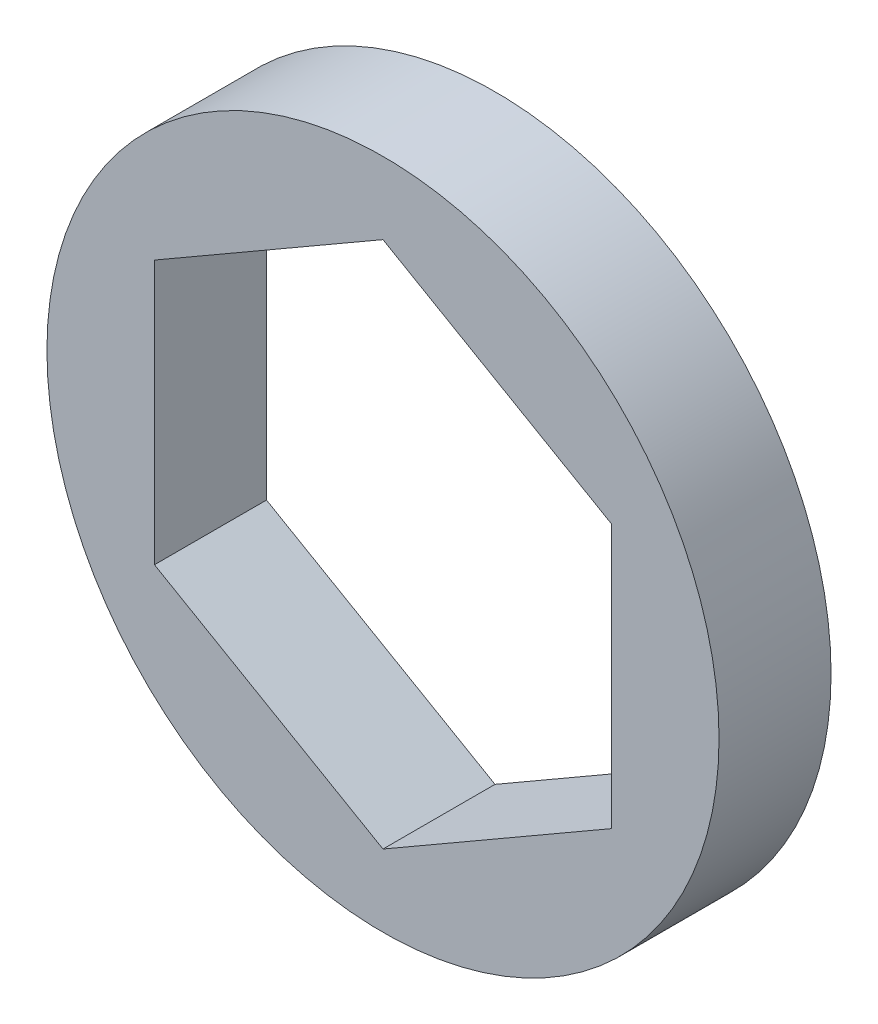
ISO-10303-21;
HEADER;
FILE_DESCRIPTION(('STEP AP214'),'2;1');
FILE_NAME('part.step','',(''),(''),'','','');
FILE_SCHEMA(('AUTOMOTIVE_DESIGN { 1 0 10303 214 1 1 1 1 }'));
ENDSEC;
DATA;
#1=APPLICATION_CONTEXT('core data for automotive mechanical design processes');
#2=APPLICATION_PROTOCOL_DEFINITION('international standard','automotive_design',2000,#1);
#3=PRODUCT_CONTEXT('',#1,'mechanical');
#4=PRODUCT('Part','Part','',(#3));
#5=PRODUCT_RELATED_PRODUCT_CATEGORY('part','',(#4));
#6=PRODUCT_DEFINITION_FORMATION('','',#4);
#7=PRODUCT_DEFINITION_CONTEXT('part definition',#1,'design');
#8=PRODUCT_DEFINITION('design','',#6,#7);
#9=PRODUCT_DEFINITION_SHAPE('','',#8);
#10=(LENGTH_UNIT() NAMED_UNIT(*) SI_UNIT(.MILLI.,.METRE.));
#11=(NAMED_UNIT(*) PLANE_ANGLE_UNIT() SI_UNIT($,.RADIAN.));
#12=(NAMED_UNIT(*) SI_UNIT($,.STERADIAN.) SOLID_ANGLE_UNIT());
#13=UNCERTAINTY_MEASURE_WITH_UNIT(LENGTH_MEASURE(1.E-05),#10,'distance_accuracy_value','');
#14=(GEOMETRIC_REPRESENTATION_CONTEXT(3) GLOBAL_UNCERTAINTY_ASSIGNED_CONTEXT((#13)) GLOBAL_UNIT_ASSIGNED_CONTEXT((#10,
#11,#12)) REPRESENTATION_CONTEXT('',''));
#15=CARTESIAN_POINT('',(0.,0.,0.));
#16=DIRECTION('',(0.,0.,1.));
#17=DIRECTION('',(1.,0.,0.));
#18=AXIS2_PLACEMENT_3D('',#15,#16,#17);
#19=CARTESIAN_POINT('',(0.,0.,-1.5875));
#20=DIRECTION('',(0.,0.,1.));
#21=DIRECTION('',(1.,0.,0.));
#22=AXIS2_PLACEMENT_3D('',#19,#20,#21);
#23=PLANE('',#22);
#24=DIRECTION('',(0.,1.,0.));
#25=VECTOR('',#24,1.);
#26=CARTESIAN_POINT('',(-6.477,3.73949769354121,-1.5875));
#27=LINE('',#26,#25);
#28=CARTESIAN_POINT('',(-6.47700000000001,-3.73949769354121,-1.5875));
#29=VERTEX_POINT('',#28);
#30=CARTESIAN_POINT('',(-6.47700000000001,3.73949769354121,-1.5875));
#31=VERTEX_POINT('',#30);
#32=EDGE_CURVE('E73',#29,#31,#27,.T.);
#33=ORIENTED_EDGE('',*,*,#32,.F.);
#34=DIRECTION('',(-0.866025403784439,0.5,0.));
#35=VECTOR('',#34,1.);
#36=CARTESIAN_POINT('',(-6.47700000000001,-3.73949769354121,-1.5875));
#37=LINE('',#36,#35);
#38=CARTESIAN_POINT('',(0.,-7.47899538708242,-1.5875));
#39=VERTEX_POINT('',#38);
#40=EDGE_CURVE('E103',#39,#29,#37,.T.);
#41=ORIENTED_EDGE('',*,*,#40,.F.);
#42=DIRECTION('',(-0.866025403784439,-0.5,0.));
#43=VECTOR('',#42,1.);
#44=CARTESIAN_POINT('',(0.,-7.47899538708242,-1.5875));
#45=LINE('',#44,#43);
#46=CARTESIAN_POINT('',(6.47700000000001,-3.73949769354122,-1.5875));
#47=VERTEX_POINT('',#46);
#48=EDGE_CURVE('E111',#47,#39,#45,.T.);
#49=ORIENTED_EDGE('',*,*,#48,.F.);
#50=DIRECTION('',(0.,-1.,0.));
#51=VECTOR('',#50,1.);
#52=CARTESIAN_POINT('',(6.47700000000001,-3.73949769354122,-1.5875));
#53=LINE('',#52,#51);
#54=CARTESIAN_POINT('',(6.47700000000001,3.73949769354121,-1.5875));
#55=VERTEX_POINT('',#54);
#56=EDGE_CURVE('E116',#55,#47,#53,.T.);
#57=ORIENTED_EDGE('',*,*,#56,.F.);
#58=DIRECTION('',(0.866025403784438,-0.500000000000001,0.));
#59=VECTOR('',#58,1.);
#60=CARTESIAN_POINT('',(6.47700000000001,3.73949769354121,-1.5875));
#61=LINE('',#60,#59);
#62=CARTESIAN_POINT('',(0.,7.47899538708242,-1.5875));
#63=VERTEX_POINT('',#62);
#64=EDGE_CURVE('E68',#63,#55,#61,.T.);
#65=ORIENTED_EDGE('',*,*,#64,.F.);
#66=DIRECTION('',(0.866025403784439,0.5,0.));
#67=VECTOR('',#66,1.);
#68=CARTESIAN_POINT('',(0.,7.47899538708242,-1.5875));
#69=LINE('',#68,#67);
#70=EDGE_CURVE('E70',#31,#63,#69,.T.);
#71=ORIENTED_EDGE('',*,*,#70,.F.);
#72=EDGE_LOOP('',(#33,#41,#49,#57,#65,#71));
#73=FACE_BOUND('',#72,.T.);
#74=CARTESIAN_POINT('',(0.,0.,-1.5875));
#75=DIRECTION('',(0.,0.,-1.));
#76=DIRECTION('',(-1.,0.,0.));
#77=AXIS2_PLACEMENT_3D('',#74,#75,#76);
#78=CIRCLE('',#77,9.525);
#79=CARTESIAN_POINT('',(-9.525,0.,-1.5875));
#80=VERTEX_POINT('',#79);
#81=EDGE_CURVE('E20',#80,#80,#78,.F.);
#82=ORIENTED_EDGE('',*,*,#81,.F.);
#83=EDGE_LOOP('',(#82));
#84=FACE_BOUND('',#83,.T.);
#85=ADVANCED_FACE('F17',(#73,#84),#23,.F.);
#86=CARTESIAN_POINT('',(0.,0.,1.5875));
#87=DIRECTION('',(0.,0.,-1.));
#88=DIRECTION('',(-1.,0.,0.));
#89=AXIS2_PLACEMENT_3D('',#86,#87,#88);
#90=CYLINDRICAL_SURFACE('',#89,9.525);
#91=ORIENTED_EDGE('',*,*,#81,.T.);
#92=EDGE_LOOP('',(#91));
#93=FACE_BOUND('',#92,.T.);
#94=CARTESIAN_POINT('',(0.,0.,1.5875));
#95=DIRECTION('',(0.,0.,-1.));
#96=DIRECTION('',(-1.,0.,0.));
#97=AXIS2_PLACEMENT_3D('',#94,#95,#96);
#98=CIRCLE('',#97,9.525);
#99=CARTESIAN_POINT('',(-9.525,0.,1.5875));
#100=VERTEX_POINT('',#99);
#101=EDGE_CURVE('E95',#100,#100,#98,.F.);
#102=ORIENTED_EDGE('',*,*,#101,.F.);
#103=EDGE_LOOP('',(#102));
#104=FACE_BOUND('',#103,.T.);
#105=ADVANCED_FACE('F153',(#93,#104),#90,.T.);
#106=CARTESIAN_POINT('',(-6.477,3.73949769354121,1.5875));
#107=DIRECTION('',(1.,0.,0.));
#108=DIRECTION('',(0.,1.,0.));
#109=AXIS2_PLACEMENT_3D('',#106,#107,#108);
#110=PLANE('',#109);
#111=DIRECTION('',(0.,1.,0.));
#112=VECTOR('',#111,1.);
#113=CARTESIAN_POINT('',(-6.47700000000001,0.,1.5875));
#114=LINE('',#113,#112);
#115=CARTESIAN_POINT('',(-6.47700000000001,-3.73949769354121,1.5875));
#116=VERTEX_POINT('',#115);
#117=CARTESIAN_POINT('',(-6.47700000000001,3.73949769354121,1.5875));
#118=VERTEX_POINT('',#117);
#119=EDGE_CURVE('E97',#116,#118,#114,.T.);
#120=ORIENTED_EDGE('',*,*,#119,.F.);
#121=DIRECTION('',(0.,0.,1.));
#122=VECTOR('',#121,1.);
#123=CARTESIAN_POINT('',(-6.47700000000001,-3.73949769354121,1.5875));
#124=LINE('',#123,#122);
#125=EDGE_CURVE('E84',#29,#116,#124,.T.);
#126=ORIENTED_EDGE('',*,*,#125,.F.);
#127=ORIENTED_EDGE('',*,*,#32,.T.);
#128=DIRECTION('',(0.,0.,1.));
#129=VECTOR('',#128,1.);
#130=CARTESIAN_POINT('',(-6.477,3.73949769354121,1.5875));
#131=LINE('',#130,#129);
#132=EDGE_CURVE('E78',#118,#31,#131,.F.);
#133=ORIENTED_EDGE('',*,*,#132,.F.);
#134=EDGE_LOOP('',(#120,#126,#127,#133));
#135=FACE_BOUND('',#134,.T.);
#136=ADVANCED_FACE('F81',(#135),#110,.T.);
#137=CARTESIAN_POINT('',(0.,7.47899538708242,1.5875));
#138=DIRECTION('',(0.5,-0.866025403784439,0.));
#139=DIRECTION('',(0.866025403784439,0.5,0.));
#140=AXIS2_PLACEMENT_3D('',#137,#138,#139);
#141=PLANE('',#140);
#142=DIRECTION('',(0.866025403784439,0.5,0.));
#143=VECTOR('',#142,1.);
#144=CARTESIAN_POINT('',(-6.477,3.73949769354121,1.5875));
#145=LINE('',#144,#143);
#146=CARTESIAN_POINT('',(0.,7.47899538708242,1.5875));
#147=VERTEX_POINT('',#146);
#148=EDGE_CURVE('E89',#118,#147,#145,.T.);
#149=ORIENTED_EDGE('',*,*,#148,.F.);
#150=ORIENTED_EDGE('',*,*,#132,.T.);
#151=ORIENTED_EDGE('',*,*,#70,.T.);
#152=DIRECTION('',(0.,0.,1.));
#153=VECTOR('',#152,1.);
#154=CARTESIAN_POINT('',(0.,7.47899538708242,1.5875));
#155=LINE('',#154,#153);
#156=EDGE_CURVE('E92',#147,#63,#155,.F.);
#157=ORIENTED_EDGE('',*,*,#156,.F.);
#158=EDGE_LOOP('',(#149,#150,#151,#157));
#159=FACE_BOUND('',#158,.T.);
#160=ADVANCED_FACE('F87',(#159),#141,.T.);
#161=CARTESIAN_POINT('',(6.47700000000001,3.73949769354121,1.5875));
#162=DIRECTION('',(-0.500000000000001,-0.866025403784438,0.));
#163=DIRECTION('',(0.866025403784438,-0.500000000000001,0.));
#164=AXIS2_PLACEMENT_3D('',#161,#162,#163);
#165=PLANE('',#164);
#166=DIRECTION('',(0.866025403784438,-0.5,0.));
#167=VECTOR('',#166,1.);
#168=CARTESIAN_POINT('',(0.,7.47899538708242,1.5875));
#169=LINE('',#168,#167);
#170=CARTESIAN_POINT('',(6.47700000000001,3.73949769354121,1.5875));
#171=VERTEX_POINT('',#170);
#172=EDGE_CURVE('E122',#147,#171,#169,.T.);
#173=ORIENTED_EDGE('',*,*,#172,.F.);
#174=ORIENTED_EDGE('',*,*,#156,.T.);
#175=ORIENTED_EDGE('',*,*,#64,.T.);
#176=DIRECTION('',(0.,0.,1.));
#177=VECTOR('',#176,1.);
#178=CARTESIAN_POINT('',(6.47700000000001,3.73949769354121,1.5875));
#179=LINE('',#178,#177);
#180=EDGE_CURVE('E113',#171,#55,#179,.F.);
#181=ORIENTED_EDGE('',*,*,#180,.F.);
#182=EDGE_LOOP('',(#173,#174,#175,#181));
#183=FACE_BOUND('',#182,.T.);
#184=ADVANCED_FACE('F120',(#183),#165,.T.);
#185=CARTESIAN_POINT('',(6.47700000000001,-3.73949769354122,1.5875));
#186=DIRECTION('',(-1.,0.,0.));
#187=DIRECTION('',(0.,-1.,0.));
#188=AXIS2_PLACEMENT_3D('',#185,#186,#187);
#189=PLANE('',#188);
#190=DIRECTION('',(0.,1.,0.));
#191=VECTOR('',#190,1.);
#192=CARTESIAN_POINT('',(6.47700000000001,0.,1.5875));
#193=LINE('',#192,#191);
#194=CARTESIAN_POINT('',(6.47700000000001,-3.73949769354122,1.5875));
#195=VERTEX_POINT('',#194);
#196=EDGE_CURVE('E126',#171,#195,#193,.F.);
#197=ORIENTED_EDGE('',*,*,#196,.F.);
#198=ORIENTED_EDGE('',*,*,#180,.T.);
#199=ORIENTED_EDGE('',*,*,#56,.T.);
#200=DIRECTION('',(0.,0.,1.));
#201=VECTOR('',#200,1.);
#202=CARTESIAN_POINT('',(6.477,-3.73949769354122,1.5875));
#203=LINE('',#202,#201);
#204=EDGE_CURVE('E108',#195,#47,#203,.F.);
#205=ORIENTED_EDGE('',*,*,#204,.F.);
#206=EDGE_LOOP('',(#197,#198,#199,#205));
#207=FACE_BOUND('',#206,.T.);
#208=ADVANCED_FACE('F134',(#207),#189,.T.);
#209=CARTESIAN_POINT('',(0.,-7.47899538708242,1.5875));
#210=DIRECTION('',(-0.5,0.866025403784439,0.));
#211=DIRECTION('',(-0.866025403784439,-0.5,0.));
#212=AXIS2_PLACEMENT_3D('',#209,#210,#211);
#213=PLANE('',#212);
#214=DIRECTION('',(-0.866025403784439,-0.5,0.));
#215=VECTOR('',#214,1.);
#216=CARTESIAN_POINT('',(6.47700000000001,-3.73949769354122,1.5875));
#217=LINE('',#216,#215);
#218=CARTESIAN_POINT('',(0.,-7.47899538708242,1.5875));
#219=VERTEX_POINT('',#218);
#220=EDGE_CURVE('E26',#195,#219,#217,.T.);
#221=ORIENTED_EDGE('',*,*,#220,.F.);
#222=ORIENTED_EDGE('',*,*,#204,.T.);
#223=ORIENTED_EDGE('',*,*,#48,.T.);
#224=DIRECTION('',(0.,0.,1.));
#225=VECTOR('',#224,1.);
#226=CARTESIAN_POINT('',(0.,-7.47899538708242,1.5875));
#227=LINE('',#226,#225);
#228=EDGE_CURVE('E35',#219,#39,#227,.F.);
#229=ORIENTED_EDGE('',*,*,#228,.F.);
#230=EDGE_LOOP('',(#221,#222,#223,#229));
#231=FACE_BOUND('',#230,.T.);
#232=ADVANCED_FACE('F132',(#231),#213,.T.);
#233=CARTESIAN_POINT('',(-6.47700000000001,-3.73949769354121,1.5875));
#234=DIRECTION('',(0.5,0.866025403784439,0.));
#235=DIRECTION('',(-0.866025403784439,0.5,0.));
#236=AXIS2_PLACEMENT_3D('',#233,#234,#235);
#237=PLANE('',#236);
#238=DIRECTION('',(-0.866025403784438,0.5,0.));
#239=VECTOR('',#238,1.);
#240=CARTESIAN_POINT('',(0.,-7.47899538708242,1.5875));
#241=LINE('',#240,#239);
#242=EDGE_CURVE('E10',#219,#116,#241,.T.);
#243=ORIENTED_EDGE('',*,*,#242,.F.);
#244=ORIENTED_EDGE('',*,*,#228,.T.);
#245=ORIENTED_EDGE('',*,*,#40,.T.);
#246=ORIENTED_EDGE('',*,*,#125,.T.);
#247=EDGE_LOOP('',(#243,#244,#245,#246));
#248=FACE_BOUND('',#247,.T.);
#249=ADVANCED_FACE('F135',(#248),#237,.T.);
#250=CARTESIAN_POINT('',(0.,0.,1.5875));
#251=DIRECTION('',(0.,0.,1.));
#252=DIRECTION('',(1.,0.,0.));
#253=AXIS2_PLACEMENT_3D('',#250,#251,#252);
#254=PLANE('',#253);
#255=ORIENTED_EDGE('',*,*,#220,.T.);
#256=ORIENTED_EDGE('',*,*,#242,.T.);
#257=ORIENTED_EDGE('',*,*,#119,.T.);
#258=ORIENTED_EDGE('',*,*,#148,.T.);
#259=ORIENTED_EDGE('',*,*,#172,.T.);
#260=ORIENTED_EDGE('',*,*,#196,.T.);
#261=EDGE_LOOP('',(#255,#256,#257,#258,#259,#260));
#262=FACE_BOUND('',#261,.T.);
#263=ORIENTED_EDGE('',*,*,#101,.T.);
#264=EDGE_LOOP('',(#263));
#265=FACE_BOUND('',#264,.T.);
#266=ADVANCED_FACE('F129',(#262,#265),#254,.T.);
#267=CLOSED_SHELL('',(#85,#105,#136,#160,#184,#208,#232,#249,#266));
#268=MANIFOLD_SOLID_BREP('B1',#267);
#269=ADVANCED_BREP_SHAPE_REPRESENTATION('',(#18,#268),#14);
#270=SHAPE_DEFINITION_REPRESENTATION(#9,#269);
ENDSEC;
END-ISO-10303-21;
